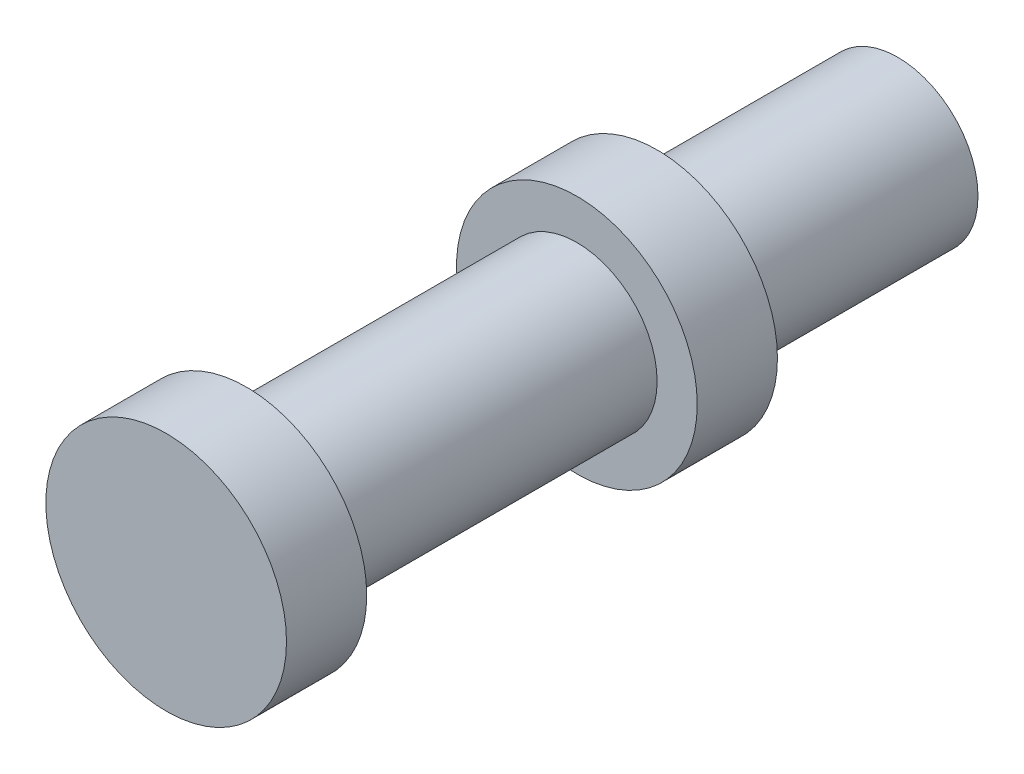
ISO-10303-21;
HEADER;
FILE_DESCRIPTION(('STEP AP214'),'2;1');
FILE_NAME('part.step','',(''),(''),'','','');
FILE_SCHEMA(('AUTOMOTIVE_DESIGN { 1 0 10303 214 1 1 1 1 }'));
ENDSEC;
DATA;
#1=APPLICATION_CONTEXT('core data for automotive mechanical design processes');
#2=APPLICATION_PROTOCOL_DEFINITION('international standard','automotive_design',2000,#1);
#3=PRODUCT_CONTEXT('',#1,'mechanical');
#4=PRODUCT('Part','Part','',(#3));
#5=PRODUCT_RELATED_PRODUCT_CATEGORY('part','',(#4));
#6=PRODUCT_DEFINITION_FORMATION('','',#4);
#7=PRODUCT_DEFINITION_CONTEXT('part definition',#1,'design');
#8=PRODUCT_DEFINITION('design','',#6,#7);
#9=PRODUCT_DEFINITION_SHAPE('','',#8);
#10=(LENGTH_UNIT() NAMED_UNIT(*) SI_UNIT(.MILLI.,.METRE.));
#11=(NAMED_UNIT(*) PLANE_ANGLE_UNIT() SI_UNIT($,.RADIAN.));
#12=(NAMED_UNIT(*) SI_UNIT($,.STERADIAN.) SOLID_ANGLE_UNIT());
#13=UNCERTAINTY_MEASURE_WITH_UNIT(LENGTH_MEASURE(1.E-05),#10,'distance_accuracy_value','');
#14=(GEOMETRIC_REPRESENTATION_CONTEXT(3) GLOBAL_UNCERTAINTY_ASSIGNED_CONTEXT((#13)) GLOBAL_UNIT_ASSIGNED_CONTEXT((#10,
#11,#12)) REPRESENTATION_CONTEXT('',''));
#15=CARTESIAN_POINT('',(0.,0.,0.));
#16=DIRECTION('',(0.,0.,1.));
#17=DIRECTION('',(1.,0.,0.));
#18=AXIS2_PLACEMENT_3D('',#15,#16,#17);
#19=CARTESIAN_POINT('',(0.,0.,9.12));
#20=DIRECTION('',(0.,0.,-1.));
#21=DIRECTION('',(-1.,0.,0.));
#22=AXIS2_PLACEMENT_3D('',#19,#20,#21);
#23=CYLINDRICAL_SURFACE('',#22,1.);
#24=CARTESIAN_POINT('',(0.,0.,4.));
#25=DIRECTION('',(0.,0.,1.));
#26=DIRECTION('',(1.,0.,0.));
#27=AXIS2_PLACEMENT_3D('',#24,#25,#26);
#28=CIRCLE('',#27,1.);
#29=CARTESIAN_POINT('',(1.,0.,4.));
#30=VERTEX_POINT('',#29);
#31=EDGE_CURVE('E51',#30,#30,#28,.T.);
#32=ORIENTED_EDGE('',*,*,#31,.T.);
#33=EDGE_LOOP('',(#32));
#34=FACE_BOUND('',#33,.T.);
#35=CARTESIAN_POINT('',(0.,0.,8.12));
#36=DIRECTION('',(0.,0.,1.));
#37=DIRECTION('',(1.,0.,0.));
#38=AXIS2_PLACEMENT_3D('',#35,#36,#37);
#39=CIRCLE('',#38,1.);
#40=CARTESIAN_POINT('',(1.,0.,8.12));
#41=VERTEX_POINT('',#40);
#42=EDGE_CURVE('E11',#41,#41,#39,.T.);
#43=ORIENTED_EDGE('',*,*,#42,.F.);
#44=EDGE_LOOP('',(#43));
#45=FACE_BOUND('',#44,.T.);
#46=ADVANCED_FACE('F37',(#34,#45),#23,.T.);
#47=CARTESIAN_POINT('',(0.,0.,0.));
#48=DIRECTION('',(0.,0.,1.));
#49=DIRECTION('',(1.,0.,0.));
#50=AXIS2_PLACEMENT_3D('',#47,#48,#49);
#51=CIRCLE('',#50,1.);
#52=CARTESIAN_POINT('',(1.,0.,0.));
#53=VERTEX_POINT('',#52);
#54=EDGE_CURVE('E47',#53,#53,#51,.T.);
#55=ORIENTED_EDGE('',*,*,#54,.T.);
#56=EDGE_LOOP('',(#55));
#57=FACE_BOUND('',#56,.T.);
#58=CARTESIAN_POINT('',(0.,0.,3.));
#59=DIRECTION('',(0.,0.,1.));
#60=DIRECTION('',(1.,0.,0.));
#61=AXIS2_PLACEMENT_3D('',#58,#59,#60);
#62=CIRCLE('',#61,1.);
#63=CARTESIAN_POINT('',(1.,0.,3.));
#64=VERTEX_POINT('',#63);
#65=EDGE_CURVE('E43',#64,#64,#62,.T.);
#66=ORIENTED_EDGE('',*,*,#65,.F.);
#67=EDGE_LOOP('',(#66));
#68=FACE_BOUND('',#67,.T.);
#69=ADVANCED_FACE('F86',(#57,#68),#23,.T.);
#70=CARTESIAN_POINT('',(0.,0.,0.));
#71=DIRECTION('',(0.,0.,1.));
#72=DIRECTION('',(1.,0.,0.));
#73=AXIS2_PLACEMENT_3D('',#70,#71,#72);
#74=PLANE('',#73);
#75=ORIENTED_EDGE('',*,*,#54,.F.);
#76=EDGE_LOOP('',(#75));
#77=FACE_BOUND('',#76,.T.);
#78=ADVANCED_FACE('F91',(#77),#74,.F.);
#79=CARTESIAN_POINT('',(0.,0.,3.));
#80=DIRECTION('',(0.,0.,1.));
#81=DIRECTION('',(1.,0.,0.));
#82=AXIS2_PLACEMENT_3D('',#79,#80,#81);
#83=PLANE('',#82);
#84=ORIENTED_EDGE('',*,*,#65,.T.);
#85=EDGE_LOOP('',(#84));
#86=FACE_BOUND('',#85,.T.);
#87=CARTESIAN_POINT('',(0.,0.,3.));
#88=DIRECTION('',(0.,0.,-1.));
#89=DIRECTION('',(-1.,0.,0.));
#90=AXIS2_PLACEMENT_3D('',#87,#88,#89);
#91=CIRCLE('',#90,1.5);
#92=CARTESIAN_POINT('',(1.5,0.,3.));
#93=VERTEX_POINT('',#92);
#94=EDGE_CURVE('E59',#93,#93,#91,.T.);
#95=ORIENTED_EDGE('',*,*,#94,.T.);
#96=EDGE_LOOP('',(#95));
#97=FACE_BOUND('',#96,.T.);
#98=ADVANCED_FACE('F84',(#86,#97),#83,.F.);
#99=CARTESIAN_POINT('',(0.,0.,4.));
#100=DIRECTION('',(0.,0.,1.));
#101=DIRECTION('',(1.,0.,0.));
#102=AXIS2_PLACEMENT_3D('',#99,#100,#101);
#103=PLANE('',#102);
#104=ORIENTED_EDGE('',*,*,#31,.F.);
#105=EDGE_LOOP('',(#104));
#106=FACE_BOUND('',#105,.T.);
#107=CARTESIAN_POINT('',(0.,0.,4.));
#108=DIRECTION('',(0.,0.,-1.));
#109=DIRECTION('',(-1.,0.,0.));
#110=AXIS2_PLACEMENT_3D('',#107,#108,#109);
#111=CIRCLE('',#110,1.5);
#112=CARTESIAN_POINT('',(1.5,0.,4.));
#113=VERTEX_POINT('',#112);
#114=EDGE_CURVE('E55',#113,#113,#111,.T.);
#115=ORIENTED_EDGE('',*,*,#114,.F.);
#116=EDGE_LOOP('',(#115));
#117=FACE_BOUND('',#116,.T.);
#118=ADVANCED_FACE('F96',(#106,#117),#103,.T.);
#119=CARTESIAN_POINT('',(0.,0.,3.));
#120=DIRECTION('',(0.,0.,1.));
#121=DIRECTION('',(1.,0.,0.));
#122=AXIS2_PLACEMENT_3D('',#119,#120,#121);
#123=CYLINDRICAL_SURFACE('',#122,1.5);
#124=CARTESIAN_POINT('',(1.5,0.,3.));
#125=CARTESIAN_POINT('',(1.5,0.,3.01041666666667));
#126=CARTESIAN_POINT('',(1.5,0.,3.02083333333333));
#127=CARTESIAN_POINT('',(1.5,0.,3.04166666666667));
#128=CARTESIAN_POINT('',(1.5,0.,3.05208333333333));
#129=CARTESIAN_POINT('',(1.5,0.,3.07291666666667));
#130=CARTESIAN_POINT('',(1.5,0.,3.08333333333333));
#131=CARTESIAN_POINT('',(1.5,0.,3.10416666666667));
#132=CARTESIAN_POINT('',(1.5,0.,3.11458333333333));
#133=CARTESIAN_POINT('',(1.5,0.,3.13541666666667));
#134=CARTESIAN_POINT('',(1.5,0.,3.14583333333333));
#135=CARTESIAN_POINT('',(1.5,0.,3.16666666666667));
#136=CARTESIAN_POINT('',(1.5,0.,3.17708333333333));
#137=CARTESIAN_POINT('',(1.5,0.,3.19791666666667));
#138=CARTESIAN_POINT('',(1.5,0.,3.20833333333333));
#139=CARTESIAN_POINT('',(1.5,0.,3.22916666666667));
#140=CARTESIAN_POINT('',(1.5,0.,3.23958333333333));
#141=CARTESIAN_POINT('',(1.5,0.,3.26041666666667));
#142=CARTESIAN_POINT('',(1.5,0.,3.27083333333333));
#143=CARTESIAN_POINT('',(1.5,0.,3.29166666666667));
#144=CARTESIAN_POINT('',(1.5,0.,3.30208333333333));
#145=CARTESIAN_POINT('',(1.5,0.,3.32291666666667));
#146=CARTESIAN_POINT('',(1.5,0.,3.33333333333333));
#147=CARTESIAN_POINT('',(1.5,0.,3.35416666666667));
#148=CARTESIAN_POINT('',(1.5,0.,3.36458333333333));
#149=CARTESIAN_POINT('',(1.5,0.,3.38541666666667));
#150=CARTESIAN_POINT('',(1.5,0.,3.39583333333333));
#151=CARTESIAN_POINT('',(1.5,0.,3.41666666666667));
#152=CARTESIAN_POINT('',(1.5,0.,3.42708333333333));
#153=CARTESIAN_POINT('',(1.5,0.,3.44791666666667));
#154=CARTESIAN_POINT('',(1.5,0.,3.45833333333333));
#155=CARTESIAN_POINT('',(1.5,0.,3.47916666666667));
#156=CARTESIAN_POINT('',(1.5,0.,3.48958333333333));
#157=CARTESIAN_POINT('',(1.5,0.,3.51041666666667));
#158=CARTESIAN_POINT('',(1.5,0.,3.52083333333333));
#159=CARTESIAN_POINT('',(1.5,0.,3.54166666666667));
#160=CARTESIAN_POINT('',(1.5,0.,3.55208333333333));
#161=CARTESIAN_POINT('',(1.5,0.,3.57291666666667));
#162=CARTESIAN_POINT('',(1.5,0.,3.58333333333333));
#163=CARTESIAN_POINT('',(1.5,0.,3.60416666666667));
#164=CARTESIAN_POINT('',(1.5,0.,3.61458333333333));
#165=CARTESIAN_POINT('',(1.5,0.,3.63541666666667));
#166=CARTESIAN_POINT('',(1.5,0.,3.64583333333333));
#167=CARTESIAN_POINT('',(1.5,0.,3.66666666666667));
#168=CARTESIAN_POINT('',(1.5,0.,3.67708333333333));
#169=CARTESIAN_POINT('',(1.5,0.,3.69791666666667));
#170=CARTESIAN_POINT('',(1.5,0.,3.70833333333333));
#171=CARTESIAN_POINT('',(1.5,0.,3.72916666666667));
#172=CARTESIAN_POINT('',(1.5,0.,3.73958333333333));
#173=CARTESIAN_POINT('',(1.5,0.,3.76041666666667));
#174=CARTESIAN_POINT('',(1.5,0.,3.77083333333333));
#175=CARTESIAN_POINT('',(1.5,0.,3.79166666666667));
#176=CARTESIAN_POINT('',(1.5,0.,3.80208333333333));
#177=CARTESIAN_POINT('',(1.5,0.,3.82291666666667));
#178=CARTESIAN_POINT('',(1.5,0.,3.83333333333333));
#179=CARTESIAN_POINT('',(1.5,0.,3.85416666666667));
#180=CARTESIAN_POINT('',(1.5,0.,3.86458333333333));
#181=CARTESIAN_POINT('',(1.5,0.,3.88541666666667));
#182=CARTESIAN_POINT('',(1.5,0.,3.89583333333333));
#183=CARTESIAN_POINT('',(1.5,0.,3.91666666666667));
#184=CARTESIAN_POINT('',(1.5,0.,3.92708333333333));
#185=CARTESIAN_POINT('',(1.5,0.,3.94791666666667));
#186=CARTESIAN_POINT('',(1.5,0.,3.95833333333333));
#187=CARTESIAN_POINT('',(1.5,0.,3.97916666666667));
#188=CARTESIAN_POINT('',(1.5,0.,3.98958333333333));
#189=CARTESIAN_POINT('',(1.5,0.,4.));
#190=B_SPLINE_CURVE_WITH_KNOTS('',3,(#124,#125,#126,#127,#128,#129,#130,#131,#132,#133,#134,
#135,#136,#137,#138,#139,#140,#141,#142,#143,#144,#145,#146,#147,#148,#149,#150,#151,#152,#153,
#154,#155,#156,#157,#158,#159,#160,#161,#162,#163,#164,#165,#166,#167,#168,#169,#170,#171,#172,
#173,#174,#175,#176,#177,#178,#179,#180,#181,#182,#183,#184,#185,#186,#187,#188,#189),
.UNSPECIFIED.,.F.,.F.,(4,2,2,2,2,2,2,2,2,2,2,2,2,2,2,2,2,2,2,2,2,2,2,2,2,2,2,2,2,2,2,2,4),(0.,
0.03125,0.0625000000000001,0.0937500000000001,0.125,0.15625,0.1875,0.21875,0.25,0.28125,0.3125,
0.34375,0.375,0.40625,0.4375,0.46875,0.5,0.53125,0.5625,0.593750000000001,0.625000000000001,
0.656250000000001,0.687500000000001,0.718750000000001,0.750000000000001,0.78125,0.8125,0.84375,
0.875,0.906250000000001,0.9375,0.96875,1.),.UNSPECIFIED.);
#191=EDGE_CURVE('BSEAM82',#93,#113,#190,.T.);
#192=ORIENTED_EDGE('',*,*,#94,.F.);
#193=ORIENTED_EDGE('',*,*,#114,.T.);
#194=ORIENTED_EDGE('',*,*,#191,.T.);
#195=ORIENTED_EDGE('',*,*,#191,.F.);
#196=EDGE_LOOP('',(#192,#194,#193,#195));
#197=FACE_BOUND('',#196,.T.);
#198=ADVANCED_FACE('F82',(#197),#123,.T.);
#199=CARTESIAN_POINT('',(0.,0.,8.12));
#200=DIRECTION('',(0.,0.,1.));
#201=DIRECTION('',(1.,0.,0.));
#202=AXIS2_PLACEMENT_3D('',#199,#200,#201);
#203=CYLINDRICAL_SURFACE('',#202,1.5);
#204=CARTESIAN_POINT('',(0.,0.,8.12));
#205=DIRECTION('',(0.,0.,1.));
#206=DIRECTION('',(1.,0.,0.));
#207=AXIS2_PLACEMENT_3D('',#204,#205,#206);
#208=CIRCLE('',#207,1.5);
#209=CARTESIAN_POINT('',(1.5,0.,8.12));
#210=VERTEX_POINT('',#209);
#211=EDGE_CURVE('E62',#210,#210,#208,.T.);
#212=ORIENTED_EDGE('',*,*,#211,.T.);
#213=EDGE_LOOP('',(#212));
#214=FACE_BOUND('',#213,.T.);
#215=CARTESIAN_POINT('',(0.,0.,9.12));
#216=DIRECTION('',(0.,0.,1.));
#217=DIRECTION('',(1.,0.,0.));
#218=AXIS2_PLACEMENT_3D('',#215,#216,#217);
#219=CIRCLE('',#218,1.5);
#220=CARTESIAN_POINT('',(1.5,0.,9.12));
#221=VERTEX_POINT('',#220);
#222=EDGE_CURVE('E63',#221,#221,#219,.T.);
#223=ORIENTED_EDGE('',*,*,#222,.F.);
#224=EDGE_LOOP('',(#223));
#225=FACE_BOUND('',#224,.T.);
#226=ADVANCED_FACE('F69',(#214,#225),#203,.T.);
#227=CARTESIAN_POINT('',(0.,0.,8.12));
#228=DIRECTION('',(0.,0.,1.));
#229=DIRECTION('',(1.,0.,0.));
#230=AXIS2_PLACEMENT_3D('',#227,#228,#229);
#231=PLANE('',#230);
#232=ORIENTED_EDGE('',*,*,#42,.T.);
#233=EDGE_LOOP('',(#232));
#234=FACE_BOUND('',#233,.T.);
#235=ORIENTED_EDGE('',*,*,#211,.F.);
#236=EDGE_LOOP('',(#235));
#237=FACE_BOUND('',#236,.T.);
#238=ADVANCED_FACE('F72',(#234,#237),#231,.F.);
#239=CARTESIAN_POINT('',(0.,0.,9.12));
#240=DIRECTION('',(0.,0.,1.));
#241=DIRECTION('',(1.,0.,0.));
#242=AXIS2_PLACEMENT_3D('',#239,#240,#241);
#243=PLANE('',#242);
#244=ORIENTED_EDGE('',*,*,#222,.T.);
#245=EDGE_LOOP('',(#244));
#246=FACE_BOUND('',#245,.T.);
#247=ADVANCED_FACE('F74',(#246),#243,.T.);
#248=CLOSED_SHELL('',(#46,#69,#78,#98,#118,#198,#226,#238,#247));
#249=MANIFOLD_SOLID_BREP('B2',#248);
#250=ADVANCED_BREP_SHAPE_REPRESENTATION('',(#18,#249),#14);
#251=SHAPE_DEFINITION_REPRESENTATION(#9,#250);
ENDSEC;
END-ISO-10303-21;
